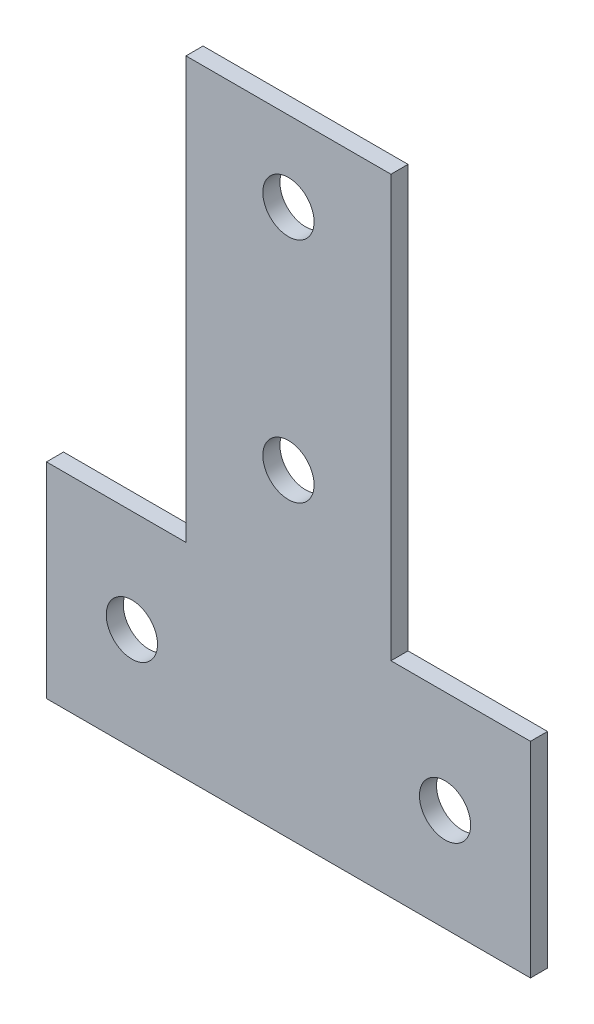
ISO-10303-21;
HEADER;
FILE_DESCRIPTION(('STEP AP214'),'2;1');
FILE_NAME('part.step','',(''),(''),'','','');
FILE_SCHEMA(('AUTOMOTIVE_DESIGN { 1 0 10303 214 1 1 1 1 }'));
ENDSEC;
DATA;
#1=APPLICATION_CONTEXT('core data for automotive mechanical design processes');
#2=APPLICATION_PROTOCOL_DEFINITION('international standard','automotive_design',2000,#1);
#3=PRODUCT_CONTEXT('',#1,'mechanical');
#4=PRODUCT('Part','Part','',(#3));
#5=PRODUCT_RELATED_PRODUCT_CATEGORY('part','',(#4));
#6=PRODUCT_DEFINITION_FORMATION('','',#4);
#7=PRODUCT_DEFINITION_CONTEXT('part definition',#1,'design');
#8=PRODUCT_DEFINITION('design','',#6,#7);
#9=PRODUCT_DEFINITION_SHAPE('','',#8);
#10=(LENGTH_UNIT() NAMED_UNIT(*) SI_UNIT(.MILLI.,.METRE.));
#11=(NAMED_UNIT(*) PLANE_ANGLE_UNIT() SI_UNIT($,.RADIAN.));
#12=(NAMED_UNIT(*) SI_UNIT($,.STERADIAN.) SOLID_ANGLE_UNIT());
#13=UNCERTAINTY_MEASURE_WITH_UNIT(LENGTH_MEASURE(1.E-05),#10,'distance_accuracy_value','');
#14=(GEOMETRIC_REPRESENTATION_CONTEXT(3) GLOBAL_UNCERTAINTY_ASSIGNED_CONTEXT((#13)) GLOBAL_UNIT_ASSIGNED_CONTEXT((#10,
#11,#12)) REPRESENTATION_CONTEXT('',''));
#15=CARTESIAN_POINT('',(0.,0.,0.));
#16=DIRECTION('',(0.,0.,1.));
#17=DIRECTION('',(1.,0.,0.));
#18=AXIS2_PLACEMENT_3D('',#15,#16,#17);
#19=CARTESIAN_POINT('',(0.,0.,3.));
#20=DIRECTION('',(0.,0.,1.));
#21=DIRECTION('',(1.,0.,0.));
#22=AXIS2_PLACEMENT_3D('',#19,#20,#21);
#23=PLANE('',#22);
#24=CARTESIAN_POINT('',(-27.5,18.,3.));
#25=DIRECTION('',(0.,0.,1.));
#26=DIRECTION('',(1.,0.,0.));
#27=AXIS2_PLACEMENT_3D('',#24,#25,#26);
#28=CIRCLE('',#27,4.5);
#29=CARTESIAN_POINT('',(-23.,18.,3.));
#30=VERTEX_POINT('',#29);
#31=EDGE_CURVE('E189',#30,#30,#28,.T.);
#32=ORIENTED_EDGE('',*,*,#31,.F.);
#33=EDGE_LOOP('',(#32));
#34=FACE_BOUND('',#33,.T.);
#35=CARTESIAN_POINT('',(0.,96.,3.));
#36=DIRECTION('',(0.,0.,1.));
#37=DIRECTION('',(1.,0.,0.));
#38=AXIS2_PLACEMENT_3D('',#35,#36,#37);
#39=CIRCLE('',#38,4.5);
#40=CARTESIAN_POINT('',(4.5,96.,3.));
#41=VERTEX_POINT('',#40);
#42=EDGE_CURVE('E135',#41,#41,#39,.T.);
#43=ORIENTED_EDGE('',*,*,#42,.F.);
#44=EDGE_LOOP('',(#43));
#45=FACE_BOUND('',#44,.T.);
#46=DIRECTION('',(0.,1.,0.));
#47=VECTOR('',#46,1.);
#48=CARTESIAN_POINT('',(42.5,36.,3.));
#49=LINE('',#48,#47);
#50=CARTESIAN_POINT('',(42.5,0.,3.));
#51=VERTEX_POINT('',#50);
#52=CARTESIAN_POINT('',(42.5,36.,3.));
#53=VERTEX_POINT('',#52);
#54=EDGE_CURVE('E146',#51,#53,#49,.T.);
#55=ORIENTED_EDGE('',*,*,#54,.T.);
#56=DIRECTION('',(-1.,0.,0.));
#57=VECTOR('',#56,1.);
#58=CARTESIAN_POINT('',(18.,36.,3.));
#59=LINE('',#58,#57);
#60=CARTESIAN_POINT('',(18.,36.,3.));
#61=VERTEX_POINT('',#60);
#62=EDGE_CURVE('E94',#53,#61,#59,.T.);
#63=ORIENTED_EDGE('',*,*,#62,.T.);
#64=DIRECTION('',(0.,1.,0.));
#65=VECTOR('',#64,1.);
#66=CARTESIAN_POINT('',(18.,110.,3.));
#67=LINE('',#66,#65);
#68=CARTESIAN_POINT('',(18.,110.,3.));
#69=VERTEX_POINT('',#68);
#70=EDGE_CURVE('E161',#61,#69,#67,.T.);
#71=ORIENTED_EDGE('',*,*,#70,.T.);
#72=DIRECTION('',(-1.,0.,0.));
#73=VECTOR('',#72,1.);
#74=CARTESIAN_POINT('',(-18.,110.,3.));
#75=LINE('',#74,#73);
#76=CARTESIAN_POINT('',(-18.,110.,3.));
#77=VERTEX_POINT('',#76);
#78=EDGE_CURVE('E174',#69,#77,#75,.T.);
#79=ORIENTED_EDGE('',*,*,#78,.T.);
#80=DIRECTION('',(0.,-1.,0.));
#81=VECTOR('',#80,1.);
#82=CARTESIAN_POINT('',(-18.,36.,3.));
#83=LINE('',#82,#81);
#84=CARTESIAN_POINT('',(-18.,36.,3.));
#85=VERTEX_POINT('',#84);
#86=EDGE_CURVE('E113',#77,#85,#83,.T.);
#87=ORIENTED_EDGE('',*,*,#86,.T.);
#88=DIRECTION('',(-1.,0.,0.));
#89=VECTOR('',#88,1.);
#90=CARTESIAN_POINT('',(-42.5,36.,3.));
#91=LINE('',#90,#89);
#92=CARTESIAN_POINT('',(-42.5,36.,3.));
#93=VERTEX_POINT('',#92);
#94=EDGE_CURVE('E107',#85,#93,#91,.T.);
#95=ORIENTED_EDGE('',*,*,#94,.T.);
#96=DIRECTION('',(0.,-1.,0.));
#97=VECTOR('',#96,1.);
#98=CARTESIAN_POINT('',(-42.5,0.,3.));
#99=LINE('',#98,#97);
#100=CARTESIAN_POINT('',(-42.5,0.,3.));
#101=VERTEX_POINT('',#100);
#102=EDGE_CURVE('E111',#93,#101,#99,.T.);
#103=ORIENTED_EDGE('',*,*,#102,.T.);
#104=DIRECTION('',(1.,0.,0.));
#105=VECTOR('',#104,1.);
#106=CARTESIAN_POINT('',(-42.5,0.,3.));
#107=LINE('',#106,#105);
#108=EDGE_CURVE('E51',#101,#51,#107,.T.);
#109=ORIENTED_EDGE('',*,*,#108,.T.);
#110=EDGE_LOOP('',(#55,#63,#71,#79,#87,#95,#103,#109));
#111=FACE_BOUND('',#110,.T.);
#112=CARTESIAN_POINT('',(0.,56.,3.));
#113=DIRECTION('',(0.,0.,1.));
#114=DIRECTION('',(1.,0.,0.));
#115=AXIS2_PLACEMENT_3D('',#112,#113,#114);
#116=CIRCLE('',#115,4.5);
#117=CARTESIAN_POINT('',(4.5,56.,3.));
#118=VERTEX_POINT('',#117);
#119=EDGE_CURVE('E183',#118,#118,#116,.T.);
#120=ORIENTED_EDGE('',*,*,#119,.F.);
#121=EDGE_LOOP('',(#120));
#122=FACE_BOUND('',#121,.T.);
#123=CARTESIAN_POINT('',(27.5,18.,3.));
#124=DIRECTION('',(0.,0.,1.));
#125=DIRECTION('',(1.,0.,0.));
#126=AXIS2_PLACEMENT_3D('',#123,#124,#125);
#127=CIRCLE('',#126,4.5);
#128=CARTESIAN_POINT('',(32.,18.,3.));
#129=VERTEX_POINT('',#128);
#130=EDGE_CURVE('E195',#129,#129,#127,.T.);
#131=ORIENTED_EDGE('',*,*,#130,.F.);
#132=EDGE_LOOP('',(#131));
#133=FACE_BOUND('',#132,.T.);
#134=ADVANCED_FACE('F34',(#34,#45,#111,#122,#133),#23,.T.);
#135=CARTESIAN_POINT('',(0.,0.,0.));
#136=DIRECTION('',(0.,0.,1.));
#137=DIRECTION('',(1.,0.,0.));
#138=AXIS2_PLACEMENT_3D('',#135,#136,#137);
#139=PLANE('',#138);
#140=DIRECTION('',(0.,1.,0.));
#141=VECTOR('',#140,1.);
#142=CARTESIAN_POINT('',(42.5,36.,0.));
#143=LINE('',#142,#141);
#144=CARTESIAN_POINT('',(42.5,0.,0.));
#145=VERTEX_POINT('',#144);
#146=CARTESIAN_POINT('',(42.5,36.,0.));
#147=VERTEX_POINT('',#146);
#148=EDGE_CURVE('E131',#145,#147,#143,.T.);
#149=ORIENTED_EDGE('',*,*,#148,.F.);
#150=DIRECTION('',(1.,0.,0.));
#151=VECTOR('',#150,1.);
#152=CARTESIAN_POINT('',(-42.5,0.,0.));
#153=LINE('',#152,#151);
#154=CARTESIAN_POINT('',(-42.5,0.,0.));
#155=VERTEX_POINT('',#154);
#156=EDGE_CURVE('E86',#155,#145,#153,.T.);
#157=ORIENTED_EDGE('',*,*,#156,.F.);
#158=DIRECTION('',(0.,-1.,0.));
#159=VECTOR('',#158,1.);
#160=CARTESIAN_POINT('',(-42.5,0.,0.));
#161=LINE('',#160,#159);
#162=CARTESIAN_POINT('',(-42.5,36.,0.));
#163=VERTEX_POINT('',#162);
#164=EDGE_CURVE('E80',#163,#155,#161,.T.);
#165=ORIENTED_EDGE('',*,*,#164,.F.);
#166=DIRECTION('',(-1.,0.,0.));
#167=VECTOR('',#166,1.);
#168=CARTESIAN_POINT('',(-42.5,36.,0.));
#169=LINE('',#168,#167);
#170=CARTESIAN_POINT('',(-18.,36.,0.));
#171=VERTEX_POINT('',#170);
#172=EDGE_CURVE('E121',#171,#163,#169,.T.);
#173=ORIENTED_EDGE('',*,*,#172,.F.);
#174=DIRECTION('',(0.,-1.,0.));
#175=VECTOR('',#174,1.);
#176=CARTESIAN_POINT('',(-18.,36.,0.));
#177=LINE('',#176,#175);
#178=CARTESIAN_POINT('',(-18.,110.,0.));
#179=VERTEX_POINT('',#178);
#180=EDGE_CURVE('E141',#179,#171,#177,.T.);
#181=ORIENTED_EDGE('',*,*,#180,.F.);
#182=DIRECTION('',(-1.,0.,0.));
#183=VECTOR('',#182,1.);
#184=CARTESIAN_POINT('',(-18.,110.,0.));
#185=LINE('',#184,#183);
#186=CARTESIAN_POINT('',(18.,110.,0.));
#187=VERTEX_POINT('',#186);
#188=EDGE_CURVE('E139',#187,#179,#185,.T.);
#189=ORIENTED_EDGE('',*,*,#188,.F.);
#190=DIRECTION('',(0.,1.,0.));
#191=VECTOR('',#190,1.);
#192=CARTESIAN_POINT('',(18.,110.,0.));
#193=LINE('',#192,#191);
#194=CARTESIAN_POINT('',(18.,36.,0.));
#195=VERTEX_POINT('',#194);
#196=EDGE_CURVE('E137',#195,#187,#193,.T.);
#197=ORIENTED_EDGE('',*,*,#196,.F.);
#198=DIRECTION('',(-1.,0.,0.));
#199=VECTOR('',#198,1.);
#200=CARTESIAN_POINT('',(18.,36.,0.));
#201=LINE('',#200,#199);
#202=EDGE_CURVE('E134',#147,#195,#201,.T.);
#203=ORIENTED_EDGE('',*,*,#202,.F.);
#204=EDGE_LOOP('',(#149,#157,#165,#173,#181,#189,#197,#203));
#205=FACE_BOUND('',#204,.T.);
#206=CARTESIAN_POINT('',(0.,96.,0.));
#207=DIRECTION('',(0.,0.,1.));
#208=DIRECTION('',(1.,0.,0.));
#209=AXIS2_PLACEMENT_3D('',#206,#207,#208);
#210=CIRCLE('',#209,4.5);
#211=CARTESIAN_POINT('',(4.5,96.,0.));
#212=VERTEX_POINT('',#211);
#213=EDGE_CURVE('E180',#212,#212,#210,.T.);
#214=ORIENTED_EDGE('',*,*,#213,.T.);
#215=EDGE_LOOP('',(#214));
#216=FACE_BOUND('',#215,.T.);
#217=CARTESIAN_POINT('',(0.,56.,0.));
#218=DIRECTION('',(0.,0.,1.));
#219=DIRECTION('',(1.,0.,0.));
#220=AXIS2_PLACEMENT_3D('',#217,#218,#219);
#221=CIRCLE('',#220,4.5);
#222=CARTESIAN_POINT('',(4.5,56.,0.));
#223=VERTEX_POINT('',#222);
#224=EDGE_CURVE('E186',#223,#223,#221,.T.);
#225=ORIENTED_EDGE('',*,*,#224,.T.);
#226=EDGE_LOOP('',(#225));
#227=FACE_BOUND('',#226,.T.);
#228=CARTESIAN_POINT('',(-27.5,18.,0.));
#229=DIRECTION('',(0.,0.,1.));
#230=DIRECTION('',(1.,0.,0.));
#231=AXIS2_PLACEMENT_3D('',#228,#229,#230);
#232=CIRCLE('',#231,4.5);
#233=CARTESIAN_POINT('',(-23.,18.,0.));
#234=VERTEX_POINT('',#233);
#235=EDGE_CURVE('E192',#234,#234,#232,.T.);
#236=ORIENTED_EDGE('',*,*,#235,.T.);
#237=EDGE_LOOP('',(#236));
#238=FACE_BOUND('',#237,.T.);
#239=CARTESIAN_POINT('',(27.5,18.,0.));
#240=DIRECTION('',(0.,0.,1.));
#241=DIRECTION('',(1.,0.,0.));
#242=AXIS2_PLACEMENT_3D('',#239,#240,#241);
#243=CIRCLE('',#242,4.5);
#244=CARTESIAN_POINT('',(32.,18.,0.));
#245=VERTEX_POINT('',#244);
#246=EDGE_CURVE('E198',#245,#245,#243,.T.);
#247=ORIENTED_EDGE('',*,*,#246,.T.);
#248=EDGE_LOOP('',(#247));
#249=FACE_BOUND('',#248,.T.);
#250=ADVANCED_FACE('F165',(#205,#216,#227,#238,#249),#139,.F.);
#251=CARTESIAN_POINT('',(42.5,36.,3.));
#252=DIRECTION('',(-1.,0.,0.));
#253=DIRECTION('',(0.,0.,1.));
#254=AXIS2_PLACEMENT_3D('',#251,#252,#253);
#255=PLANE('',#254);
#256=ORIENTED_EDGE('',*,*,#148,.T.);
#257=DIRECTION('',(0.,0.,-1.));
#258=VECTOR('',#257,1.);
#259=CARTESIAN_POINT('',(42.5,36.,3.));
#260=LINE('',#259,#258);
#261=EDGE_CURVE('E11',#53,#147,#260,.T.);
#262=ORIENTED_EDGE('',*,*,#261,.F.);
#263=ORIENTED_EDGE('',*,*,#54,.F.);
#264=DIRECTION('',(0.,0.,-1.));
#265=VECTOR('',#264,1.);
#266=CARTESIAN_POINT('',(42.5,0.,3.));
#267=LINE('',#266,#265);
#268=EDGE_CURVE('E127',#51,#145,#267,.T.);
#269=ORIENTED_EDGE('',*,*,#268,.T.);
#270=EDGE_LOOP('',(#256,#262,#263,#269));
#271=FACE_BOUND('',#270,.T.);
#272=ADVANCED_FACE('F36',(#271),#255,.F.);
#273=CARTESIAN_POINT('',(18.,36.,3.));
#274=DIRECTION('',(0.,-1.,0.));
#275=DIRECTION('',(1.,0.,0.));
#276=AXIS2_PLACEMENT_3D('',#273,#274,#275);
#277=PLANE('',#276);
#278=ORIENTED_EDGE('',*,*,#202,.T.);
#279=DIRECTION('',(0.,0.,-1.));
#280=VECTOR('',#279,1.);
#281=CARTESIAN_POINT('',(18.,36.,3.));
#282=LINE('',#281,#280);
#283=EDGE_CURVE('E43',#61,#195,#282,.T.);
#284=ORIENTED_EDGE('',*,*,#283,.F.);
#285=ORIENTED_EDGE('',*,*,#62,.F.);
#286=ORIENTED_EDGE('',*,*,#261,.T.);
#287=EDGE_LOOP('',(#278,#284,#285,#286));
#288=FACE_BOUND('',#287,.T.);
#289=ADVANCED_FACE('F232',(#288),#277,.F.);
#290=CARTESIAN_POINT('',(18.,110.,3.));
#291=DIRECTION('',(-1.,0.,0.));
#292=DIRECTION('',(0.,-1.,0.));
#293=AXIS2_PLACEMENT_3D('',#290,#291,#292);
#294=PLANE('',#293);
#295=ORIENTED_EDGE('',*,*,#196,.T.);
#296=DIRECTION('',(0.,0.,-1.));
#297=VECTOR('',#296,1.);
#298=CARTESIAN_POINT('',(18.,110.,3.));
#299=LINE('',#298,#297);
#300=EDGE_CURVE('E153',#69,#187,#299,.T.);
#301=ORIENTED_EDGE('',*,*,#300,.F.);
#302=ORIENTED_EDGE('',*,*,#70,.F.);
#303=ORIENTED_EDGE('',*,*,#283,.T.);
#304=EDGE_LOOP('',(#295,#301,#302,#303));
#305=FACE_BOUND('',#304,.T.);
#306=ADVANCED_FACE('F159',(#305),#294,.F.);
#307=CARTESIAN_POINT('',(-18.,110.,3.));
#308=DIRECTION('',(0.,-1.,0.));
#309=DIRECTION('',(0.,0.,-1.));
#310=AXIS2_PLACEMENT_3D('',#307,#308,#309);
#311=PLANE('',#310);
#312=ORIENTED_EDGE('',*,*,#188,.T.);
#313=DIRECTION('',(0.,0.,-1.));
#314=VECTOR('',#313,1.);
#315=CARTESIAN_POINT('',(-18.,110.,3.));
#316=LINE('',#315,#314);
#317=EDGE_CURVE('E150',#77,#179,#316,.T.);
#318=ORIENTED_EDGE('',*,*,#317,.F.);
#319=ORIENTED_EDGE('',*,*,#78,.F.);
#320=ORIENTED_EDGE('',*,*,#300,.T.);
#321=EDGE_LOOP('',(#312,#318,#319,#320));
#322=FACE_BOUND('',#321,.T.);
#323=ADVANCED_FACE('F170',(#322),#311,.F.);
#324=CARTESIAN_POINT('',(-18.,36.,3.));
#325=DIRECTION('',(1.,0.,0.));
#326=DIRECTION('',(0.,1.,0.));
#327=AXIS2_PLACEMENT_3D('',#324,#325,#326);
#328=PLANE('',#327);
#329=ORIENTED_EDGE('',*,*,#180,.T.);
#330=DIRECTION('',(0.,0.,-1.));
#331=VECTOR('',#330,1.);
#332=CARTESIAN_POINT('',(-18.,36.,3.));
#333=LINE('',#332,#331);
#334=EDGE_CURVE('E122',#85,#171,#333,.T.);
#335=ORIENTED_EDGE('',*,*,#334,.F.);
#336=ORIENTED_EDGE('',*,*,#86,.F.);
#337=ORIENTED_EDGE('',*,*,#317,.T.);
#338=EDGE_LOOP('',(#329,#335,#336,#337));
#339=FACE_BOUND('',#338,.T.);
#340=ADVANCED_FACE('F173',(#339),#328,.F.);
#341=CARTESIAN_POINT('',(-42.5,36.,3.));
#342=DIRECTION('',(0.,-1.,0.));
#343=DIRECTION('',(1.,0.,0.));
#344=AXIS2_PLACEMENT_3D('',#341,#342,#343);
#345=PLANE('',#344);
#346=ORIENTED_EDGE('',*,*,#172,.T.);
#347=DIRECTION('',(0.,0.,-1.));
#348=VECTOR('',#347,1.);
#349=CARTESIAN_POINT('',(-42.5,36.,3.));
#350=LINE('',#349,#348);
#351=EDGE_CURVE('E118',#93,#163,#350,.T.);
#352=ORIENTED_EDGE('',*,*,#351,.F.);
#353=ORIENTED_EDGE('',*,*,#94,.F.);
#354=ORIENTED_EDGE('',*,*,#334,.T.);
#355=EDGE_LOOP('',(#346,#352,#353,#354));
#356=FACE_BOUND('',#355,.T.);
#357=ADVANCED_FACE('F119',(#356),#345,.F.);
#358=CARTESIAN_POINT('',(-42.5,0.,3.));
#359=DIRECTION('',(1.,0.,0.));
#360=DIRECTION('',(0.,0.,-1.));
#361=AXIS2_PLACEMENT_3D('',#358,#359,#360);
#362=PLANE('',#361);
#363=ORIENTED_EDGE('',*,*,#164,.T.);
#364=DIRECTION('',(0.,0.,-1.));
#365=VECTOR('',#364,1.);
#366=CARTESIAN_POINT('',(-42.5,0.,3.));
#367=LINE('',#366,#365);
#368=EDGE_CURVE('E123',#101,#155,#367,.T.);
#369=ORIENTED_EDGE('',*,*,#368,.F.);
#370=ORIENTED_EDGE('',*,*,#102,.F.);
#371=ORIENTED_EDGE('',*,*,#351,.T.);
#372=EDGE_LOOP('',(#363,#369,#370,#371));
#373=FACE_BOUND('',#372,.T.);
#374=ADVANCED_FACE('F125',(#373),#362,.F.);
#375=CARTESIAN_POINT('',(-42.5,0.,3.));
#376=DIRECTION('',(0.,1.,0.));
#377=DIRECTION('',(-1.,0.,0.));
#378=AXIS2_PLACEMENT_3D('',#375,#376,#377);
#379=PLANE('',#378);
#380=ORIENTED_EDGE('',*,*,#156,.T.);
#381=ORIENTED_EDGE('',*,*,#268,.F.);
#382=ORIENTED_EDGE('',*,*,#108,.F.);
#383=ORIENTED_EDGE('',*,*,#368,.T.);
#384=EDGE_LOOP('',(#380,#381,#382,#383));
#385=FACE_BOUND('',#384,.T.);
#386=ADVANCED_FACE('F220',(#385),#379,.F.);
#387=CARTESIAN_POINT('',(0.,96.,3.));
#388=DIRECTION('',(0.,0.,-1.));
#389=DIRECTION('',(-1.,0.,0.));
#390=AXIS2_PLACEMENT_3D('',#387,#388,#389);
#391=CYLINDRICAL_SURFACE('',#390,4.5);
#392=ORIENTED_EDGE('',*,*,#42,.T.);
#393=EDGE_LOOP('',(#392));
#394=FACE_BOUND('',#393,.T.);
#395=ORIENTED_EDGE('',*,*,#213,.F.);
#396=EDGE_LOOP('',(#395));
#397=FACE_BOUND('',#396,.T.);
#398=ADVANCED_FACE('F217',(#394,#397),#391,.F.);
#399=CARTESIAN_POINT('',(0.,56.,3.));
#400=DIRECTION('',(0.,0.,-1.));
#401=DIRECTION('',(-1.,0.,0.));
#402=AXIS2_PLACEMENT_3D('',#399,#400,#401);
#403=CYLINDRICAL_SURFACE('',#402,4.5);
#404=ORIENTED_EDGE('',*,*,#119,.T.);
#405=EDGE_LOOP('',(#404));
#406=FACE_BOUND('',#405,.T.);
#407=ORIENTED_EDGE('',*,*,#224,.F.);
#408=EDGE_LOOP('',(#407));
#409=FACE_BOUND('',#408,.T.);
#410=ADVANCED_FACE('F296',(#406,#409),#403,.F.);
#411=CARTESIAN_POINT('',(-27.5,18.,3.));
#412=DIRECTION('',(0.,0.,-1.));
#413=DIRECTION('',(-1.,0.,0.));
#414=AXIS2_PLACEMENT_3D('',#411,#412,#413);
#415=CYLINDRICAL_SURFACE('',#414,4.5);
#416=ORIENTED_EDGE('',*,*,#31,.T.);
#417=EDGE_LOOP('',(#416));
#418=FACE_BOUND('',#417,.T.);
#419=ORIENTED_EDGE('',*,*,#235,.F.);
#420=EDGE_LOOP('',(#419));
#421=FACE_BOUND('',#420,.T.);
#422=ADVANCED_FACE('F304',(#418,#421),#415,.F.);
#423=CARTESIAN_POINT('',(27.5,18.,3.));
#424=DIRECTION('',(0.,0.,-1.));
#425=DIRECTION('',(-1.,0.,0.));
#426=AXIS2_PLACEMENT_3D('',#423,#424,#425);
#427=CYLINDRICAL_SURFACE('',#426,4.5);
#428=ORIENTED_EDGE('',*,*,#130,.T.);
#429=EDGE_LOOP('',(#428));
#430=FACE_BOUND('',#429,.T.);
#431=ORIENTED_EDGE('',*,*,#246,.F.);
#432=EDGE_LOOP('',(#431));
#433=FACE_BOUND('',#432,.T.);
#434=ADVANCED_FACE('F204',(#430,#433),#427,.F.);
#435=CLOSED_SHELL('',(#134,#250,#272,#289,#306,#323,#340,#357,#374,#386,#398,#410,#422,#434));
#436=MANIFOLD_SOLID_BREP('B2',#435);
#437=ADVANCED_BREP_SHAPE_REPRESENTATION('',(#18,#436),#14);
#438=SHAPE_DEFINITION_REPRESENTATION(#9,#437);
ENDSEC;
END-ISO-10303-21;
